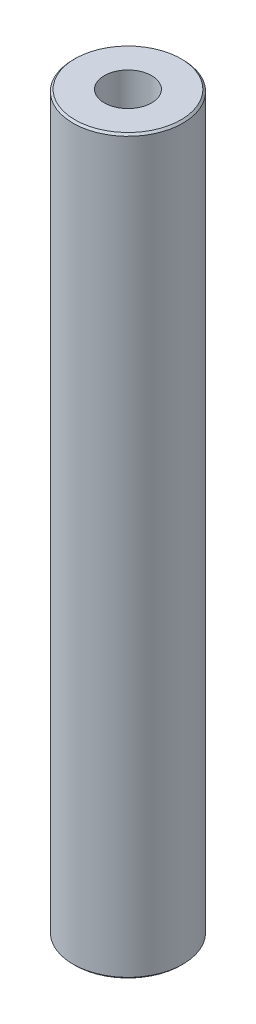
ISO-10303-21;
HEADER;
FILE_DESCRIPTION(('STEP AP214'),'2;1');
FILE_NAME('part.step','',(''),(''),'','','');
FILE_SCHEMA(('AUTOMOTIVE_DESIGN { 1 0 10303 214 1 1 1 1 }'));
ENDSEC;
DATA;
#1=APPLICATION_CONTEXT('core data for automotive mechanical design processes');
#2=APPLICATION_PROTOCOL_DEFINITION('international standard','automotive_design',2000,#1);
#3=PRODUCT_CONTEXT('',#1,'mechanical');
#4=PRODUCT('Part','Part','',(#3));
#5=PRODUCT_RELATED_PRODUCT_CATEGORY('part','',(#4));
#6=PRODUCT_DEFINITION_FORMATION('','',#4);
#7=PRODUCT_DEFINITION_CONTEXT('part definition',#1,'design');
#8=PRODUCT_DEFINITION('design','',#6,#7);
#9=PRODUCT_DEFINITION_SHAPE('','',#8);
#10=(LENGTH_UNIT() NAMED_UNIT(*) SI_UNIT(.MILLI.,.METRE.));
#11=(NAMED_UNIT(*) PLANE_ANGLE_UNIT() SI_UNIT($,.RADIAN.));
#12=(NAMED_UNIT(*) SI_UNIT($,.STERADIAN.) SOLID_ANGLE_UNIT());
#13=UNCERTAINTY_MEASURE_WITH_UNIT(LENGTH_MEASURE(1.E-05),#10,'distance_accuracy_value','');
#14=(GEOMETRIC_REPRESENTATION_CONTEXT(3) GLOBAL_UNCERTAINTY_ASSIGNED_CONTEXT((#13)) GLOBAL_UNIT_ASSIGNED_CONTEXT((#10,
#11,#12)) REPRESENTATION_CONTEXT('',''));
#15=CARTESIAN_POINT('',(0.,0.,0.));
#16=DIRECTION('',(0.,0.,1.));
#17=DIRECTION('',(1.,0.,0.));
#18=AXIS2_PLACEMENT_3D('',#15,#16,#17);
#19=CARTESIAN_POINT('',(0.,600.,0.));
#20=DIRECTION('',(0.,-1.,0.));
#21=DIRECTION('',(0.,0.,-1.));
#22=AXIS2_PLACEMENT_3D('',#19,#20,#21);
#23=CYLINDRICAL_SURFACE('',#22,45.);
#24=CARTESIAN_POINT('',(0.,598.419154239603,0.));
#25=DIRECTION('',(0.,1.,0.));
#26=DIRECTION('',(0.,0.,1.));
#27=AXIS2_PLACEMENT_3D('',#24,#25,#26);
#28=CIRCLE('',#27,45.);
#29=CARTESIAN_POINT('',(0.,598.419154239603,45.));
#30=VERTEX_POINT('',#29);
#31=EDGE_CURVE('E50',#30,#30,#28,.F.);
#32=ORIENTED_EDGE('',*,*,#31,.T.);
#33=EDGE_LOOP('',(#32));
#34=FACE_BOUND('',#33,.T.);
#35=CARTESIAN_POINT('',(0.,1.5808457603973,0.));
#36=DIRECTION('',(0.,1.,0.));
#37=DIRECTION('',(0.,0.,1.));
#38=AXIS2_PLACEMENT_3D('',#35,#36,#37);
#39=CIRCLE('',#38,45.);
#40=CARTESIAN_POINT('',(0.,1.5808457603973,45.));
#41=VERTEX_POINT('',#40);
#42=EDGE_CURVE('E51',#41,#41,#39,.T.);
#43=ORIENTED_EDGE('',*,*,#42,.T.);
#44=EDGE_LOOP('',(#43));
#45=FACE_BOUND('',#44,.T.);
#46=ADVANCED_FACE('F39',(#34,#45),#23,.T.);
#47=CARTESIAN_POINT('',(0.,600.,0.));
#48=DIRECTION('',(0.,1.,0.));
#49=DIRECTION('',(0.,0.,1.));
#50=AXIS2_PLACEMENT_3D('',#47,#48,#49);
#51=PLANE('',#50);
#52=CARTESIAN_POINT('',(0.,600.,0.));
#53=DIRECTION('',(0.,1.,0.));
#54=DIRECTION('',(0.,0.,1.));
#55=AXIS2_PLACEMENT_3D('',#52,#53,#54);
#56=CIRCLE('',#55,43.4191542396027);
#57=CARTESIAN_POINT('',(0.,600.,43.4191542396027));
#58=VERTEX_POINT('',#57);
#59=EDGE_CURVE('E54',#58,#58,#56,.T.);
#60=ORIENTED_EDGE('',*,*,#59,.T.);
#61=EDGE_LOOP('',(#60));
#62=FACE_BOUND('',#61,.T.);
#63=CARTESIAN_POINT('',(0.,600.,0.));
#64=DIRECTION('',(0.,1.,0.));
#65=DIRECTION('',(0.,0.,1.));
#66=AXIS2_PLACEMENT_3D('',#63,#64,#65);
#67=CIRCLE('',#66,19.3966479078564);
#68=CARTESIAN_POINT('',(0.,600.,19.3966479078564));
#69=VERTEX_POINT('',#68);
#70=EDGE_CURVE('E58',#69,#69,#67,.T.);
#71=ORIENTED_EDGE('',*,*,#70,.F.);
#72=EDGE_LOOP('',(#71));
#73=FACE_BOUND('',#72,.T.);
#74=ADVANCED_FACE('F69',(#62,#73),#51,.T.);
#75=CARTESIAN_POINT('',(0.,0.,0.));
#76=DIRECTION('',(0.,1.,0.));
#77=DIRECTION('',(0.,0.,1.));
#78=AXIS2_PLACEMENT_3D('',#75,#76,#77);
#79=PLANE('',#78);
#80=CARTESIAN_POINT('',(0.,0.,0.));
#81=DIRECTION('',(0.,1.,0.));
#82=DIRECTION('',(0.,0.,1.));
#83=AXIS2_PLACEMENT_3D('',#80,#81,#82);
#84=CIRCLE('',#83,43.4191542396027);
#85=CARTESIAN_POINT('',(0.,0.,43.4191542396027));
#86=VERTEX_POINT('',#85);
#87=EDGE_CURVE('E10',#86,#86,#84,.F.);
#88=ORIENTED_EDGE('',*,*,#87,.T.);
#89=EDGE_LOOP('',(#88));
#90=FACE_BOUND('',#89,.T.);
#91=CARTESIAN_POINT('',(0.,0.,0.));
#92=DIRECTION('',(0.,1.,0.));
#93=DIRECTION('',(0.,0.,1.));
#94=AXIS2_PLACEMENT_3D('',#91,#92,#93);
#95=CIRCLE('',#94,19.3966479078564);
#96=CARTESIAN_POINT('',(0.,0.,19.3966479078564));
#97=VERTEX_POINT('',#96);
#98=EDGE_CURVE('E63',#97,#97,#95,.T.);
#99=ORIENTED_EDGE('',*,*,#98,.T.);
#100=EDGE_LOOP('',(#99));
#101=FACE_BOUND('',#100,.T.);
#102=ADVANCED_FACE('F75',(#90,#101),#79,.F.);
#103=CARTESIAN_POINT('',(0.,600.,0.));
#104=DIRECTION('',(0.,-1.,0.));
#105=DIRECTION('',(0.,0.,-1.));
#106=AXIS2_PLACEMENT_3D('',#103,#104,#105);
#107=CYLINDRICAL_SURFACE('',#106,19.3966479078564);
#108=ORIENTED_EDGE('',*,*,#70,.T.);
#109=EDGE_LOOP('',(#108));
#110=FACE_BOUND('',#109,.T.);
#111=ORIENTED_EDGE('',*,*,#98,.F.);
#112=EDGE_LOOP('',(#111));
#113=FACE_BOUND('',#112,.T.);
#114=ADVANCED_FACE('F70',(#110,#113),#107,.F.);
#115=CARTESIAN_POINT('',(0.,600.,0.));
#116=DIRECTION('',(0.,-1.,0.));
#117=DIRECTION('',(0.,0.,-1.));
#118=AXIS2_PLACEMENT_3D('',#115,#116,#117);
#119=CONICAL_SURFACE('',#118,43.4191542396027,0.785398163397437);
#120=ORIENTED_EDGE('',*,*,#31,.F.);
#121=EDGE_LOOP('',(#120));
#122=FACE_BOUND('',#121,.T.);
#123=ORIENTED_EDGE('',*,*,#59,.F.);
#124=EDGE_LOOP('',(#123));
#125=FACE_BOUND('',#124,.T.);
#126=ADVANCED_FACE('F81',(#122,#125),#119,.T.);
#127=CARTESIAN_POINT('',(0.,1.5808457603973,0.));
#128=DIRECTION('',(0.,1.,0.));
#129=DIRECTION('',(0.,0.,1.));
#130=AXIS2_PLACEMENT_3D('',#127,#128,#129);
#131=CONICAL_SURFACE('',#130,45.,0.785398163397457);
#132=ORIENTED_EDGE('',*,*,#87,.F.);
#133=EDGE_LOOP('',(#132));
#134=FACE_BOUND('',#133,.T.);
#135=ORIENTED_EDGE('',*,*,#42,.F.);
#136=EDGE_LOOP('',(#135));
#137=FACE_BOUND('',#136,.T.);
#138=ADVANCED_FACE('F45',(#134,#137),#131,.T.);
#139=CLOSED_SHELL('',(#46,#74,#102,#114,#126,#138));
#140=MANIFOLD_SOLID_BREP('B2',#139);
#141=ADVANCED_BREP_SHAPE_REPRESENTATION('',(#18,#140),#14);
#142=SHAPE_DEFINITION_REPRESENTATION(#9,#141);
ENDSEC;
END-ISO-10303-21;
